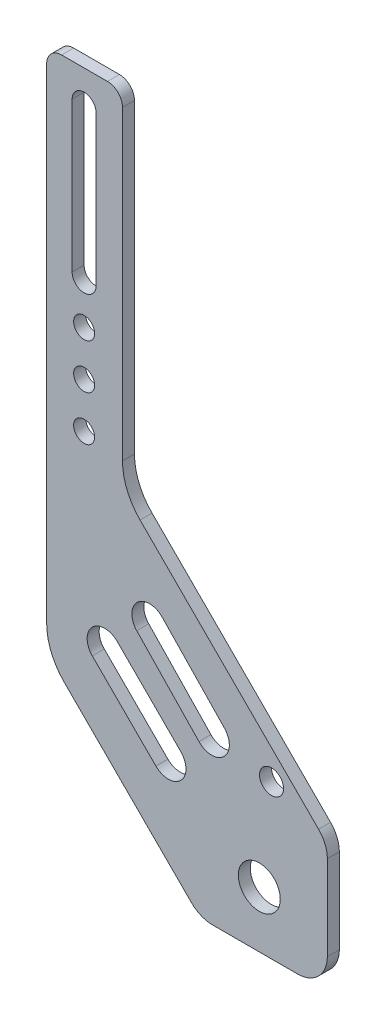
ISO-10303-21;
HEADER;
FILE_DESCRIPTION(('STEP AP214'),'2;1');
FILE_NAME('part.step','',(''),(''),'','','');
FILE_SCHEMA(('AUTOMOTIVE_DESIGN { 1 0 10303 214 1 1 1 1 }'));
ENDSEC;
DATA;
#1=APPLICATION_CONTEXT('core data for automotive mechanical design processes');
#2=APPLICATION_PROTOCOL_DEFINITION('international standard','automotive_design',2000,#1);
#3=PRODUCT_CONTEXT('',#1,'mechanical');
#4=PRODUCT('Part','Part','',(#3));
#5=PRODUCT_RELATED_PRODUCT_CATEGORY('part','',(#4));
#6=PRODUCT_DEFINITION_FORMATION('','',#4);
#7=PRODUCT_DEFINITION_CONTEXT('part definition',#1,'design');
#8=PRODUCT_DEFINITION('design','',#6,#7);
#9=PRODUCT_DEFINITION_SHAPE('','',#8);
#10=(LENGTH_UNIT() NAMED_UNIT(*) SI_UNIT(.MILLI.,.METRE.));
#11=(NAMED_UNIT(*) PLANE_ANGLE_UNIT() SI_UNIT($,.RADIAN.));
#12=(NAMED_UNIT(*) SI_UNIT($,.STERADIAN.) SOLID_ANGLE_UNIT());
#13=UNCERTAINTY_MEASURE_WITH_UNIT(LENGTH_MEASURE(1.E-05),#10,'distance_accuracy_value','');
#14=(GEOMETRIC_REPRESENTATION_CONTEXT(3) GLOBAL_UNCERTAINTY_ASSIGNED_CONTEXT((#13)) GLOBAL_UNIT_ASSIGNED_CONTEXT((#10,
#11,#12)) REPRESENTATION_CONTEXT('',''));
#15=CARTESIAN_POINT('',(0.,0.,0.));
#16=DIRECTION('',(0.,0.,1.));
#17=DIRECTION('',(1.,0.,0.));
#18=AXIS2_PLACEMENT_3D('',#15,#16,#17);
#19=CARTESIAN_POINT('',(0.,-96.2377499931107,4.));
#20=DIRECTION('',(0.,1.,0.));
#21=DIRECTION('',(0.,0.,1.));
#22=AXIS2_PLACEMENT_3D('',#19,#20,#21);
#23=PLANE('',#22);
#24=DIRECTION('',(1.,0.,0.));
#25=VECTOR('',#24,1.);
#26=CARTESIAN_POINT('',(0.,-96.2377499931107,0.));
#27=LINE('',#26,#25);
#28=CARTESIAN_POINT('',(55.3798856168415,-96.2377499931107,0.));
#29=VERTEX_POINT('',#28);
#30=CARTESIAN_POINT('',(83.6641568643034,-96.2377499931107,0.));
#31=VERTEX_POINT('',#30);
#32=EDGE_CURVE('E321',#29,#31,#27,.T.);
#33=ORIENTED_EDGE('',*,*,#32,.T.);
#34=DIRECTION('',(0.,0.,-1.));
#35=VECTOR('',#34,1.);
#36=CARTESIAN_POINT('',(83.6641568643034,-96.2377499931107,4.));
#37=LINE('',#36,#35);
#38=CARTESIAN_POINT('',(83.6641568643034,-96.2377499931107,4.));
#39=VERTEX_POINT('',#38);
#40=EDGE_CURVE('E11',#39,#31,#37,.T.);
#41=ORIENTED_EDGE('',*,*,#40,.F.);
#42=DIRECTION('',(1.,0.,0.));
#43=VECTOR('',#42,1.);
#44=CARTESIAN_POINT('',(0.,-96.2377499931107,4.));
#45=LINE('',#44,#43);
#46=CARTESIAN_POINT('',(55.3798856168415,-96.2377499931107,4.));
#47=VERTEX_POINT('',#46);
#48=EDGE_CURVE('E517',#47,#39,#45,.T.);
#49=ORIENTED_EDGE('',*,*,#48,.F.);
#50=DIRECTION('',(0.,0.,-1.));
#51=VECTOR('',#50,1.);
#52=CARTESIAN_POINT('',(55.3798856168415,-96.2377499931107,4.));
#53=LINE('',#52,#51);
#54=EDGE_CURVE('E367',#47,#29,#53,.T.);
#55=ORIENTED_EDGE('',*,*,#54,.T.);
#56=EDGE_LOOP('',(#33,#41,#49,#55));
#57=FACE_BOUND('',#56,.T.);
#58=ADVANCED_FACE('F41',(#57),#23,.F.);
#59=CARTESIAN_POINT('',(83.6641568643035,-86.2377499931107,4.));
#60=DIRECTION('',(0.,0.,-1.));
#61=DIRECTION('',(-1.,0.,0.));
#62=AXIS2_PLACEMENT_3D('',#59,#60,#61);
#63=CYLINDRICAL_SURFACE('',#62,9.99999999999999);
#64=CARTESIAN_POINT('',(83.6641568643035,-86.2377499931107,0.));
#65=DIRECTION('',(0.,0.,1.));
#66=DIRECTION('',(1.,0.,0.));
#67=AXIS2_PLACEMENT_3D('',#64,#65,#66);
#68=CIRCLE('',#67,9.99999999999999);
#69=CARTESIAN_POINT('',(93.6641568643035,-86.2377499931106,0.));
#70=VERTEX_POINT('',#69);
#71=EDGE_CURVE('E325',#31,#70,#68,.T.);
#72=ORIENTED_EDGE('',*,*,#71,.T.);
#73=DIRECTION('',(0.,0.,-1.));
#74=VECTOR('',#73,1.);
#75=CARTESIAN_POINT('',(93.6641568643035,-86.2377499931106,4.));
#76=LINE('',#75,#74);
#77=CARTESIAN_POINT('',(93.6641568643035,-86.2377499931106,4.));
#78=VERTEX_POINT('',#77);
#79=EDGE_CURVE('E52',#78,#70,#76,.T.);
#80=ORIENTED_EDGE('',*,*,#79,.F.);
#81=CARTESIAN_POINT('',(83.6641568643035,-86.2377499931107,4.));
#82=DIRECTION('',(0.,0.,1.));
#83=DIRECTION('',(1.,0.,0.));
#84=AXIS2_PLACEMENT_3D('',#81,#82,#83);
#85=CIRCLE('',#84,9.99999999999999);
#86=EDGE_CURVE('E520',#39,#78,#85,.T.);
#87=ORIENTED_EDGE('',*,*,#86,.F.);
#88=ORIENTED_EDGE('',*,*,#40,.T.);
#89=EDGE_LOOP('',(#72,#80,#87,#88));
#90=FACE_BOUND('',#89,.T.);
#91=ADVANCED_FACE('F573',(#90),#63,.T.);
#92=CARTESIAN_POINT('',(93.6641568643035,0.,4.));
#93=DIRECTION('',(-1.,0.,0.));
#94=DIRECTION('',(0.,0.,1.));
#95=AXIS2_PLACEMENT_3D('',#92,#93,#94);
#96=PLANE('',#95);
#97=DIRECTION('',(0.,1.,0.));
#98=VECTOR('',#97,1.);
#99=CARTESIAN_POINT('',(93.6641568643035,0.,0.));
#100=LINE('',#99,#98);
#101=CARTESIAN_POINT('',(93.6641568643035,-57.9534787456488,0.));
#102=VERTEX_POINT('',#101);
#103=EDGE_CURVE('E328',#70,#102,#100,.T.);
#104=ORIENTED_EDGE('',*,*,#103,.T.);
#105=DIRECTION('',(0.,0.,-1.));
#106=VECTOR('',#105,1.);
#107=CARTESIAN_POINT('',(93.6641568643035,-57.9534787456488,4.));
#108=LINE('',#107,#106);
#109=CARTESIAN_POINT('',(93.6641568643035,-57.9534787456488,4.));
#110=VERTEX_POINT('',#109);
#111=EDGE_CURVE('E399',#110,#102,#108,.T.);
#112=ORIENTED_EDGE('',*,*,#111,.F.);
#113=DIRECTION('',(0.,1.,0.));
#114=VECTOR('',#113,1.);
#115=CARTESIAN_POINT('',(93.6641568643035,0.,4.));
#116=LINE('',#115,#114);
#117=EDGE_CURVE('E523',#78,#110,#116,.T.);
#118=ORIENTED_EDGE('',*,*,#117,.F.);
#119=ORIENTED_EDGE('',*,*,#79,.T.);
#120=EDGE_LOOP('',(#104,#112,#118,#119));
#121=FACE_BOUND('',#120,.T.);
#122=ADVANCED_FACE('F578',(#121),#96,.F.);
#123=CARTESIAN_POINT('',(83.6641568643035,-57.9534787456487,4.));
#124=DIRECTION('',(0.,0.,-1.));
#125=DIRECTION('',(-1.,0.,0.));
#126=AXIS2_PLACEMENT_3D('',#123,#124,#125);
#127=CYLINDRICAL_SURFACE('',#126,10.);
#128=CARTESIAN_POINT('',(83.6641568643035,-57.9534787456487,0.));
#129=DIRECTION('',(0.,0.,1.));
#130=DIRECTION('',(1.,0.,0.));
#131=AXIS2_PLACEMENT_3D('',#128,#129,#130);
#132=CIRCLE('',#131,10.);
#133=CARTESIAN_POINT('',(90.7352246761689,-50.8824109337832,0.));
#134=VERTEX_POINT('',#133);
#135=EDGE_CURVE('E331',#102,#134,#132,.T.);
#136=ORIENTED_EDGE('',*,*,#135,.T.);
#137=DIRECTION('',(0.,0.,-1.));
#138=VECTOR('',#137,1.);
#139=CARTESIAN_POINT('',(90.7352246761689,-50.8824109337832,4.));
#140=LINE('',#139,#138);
#141=CARTESIAN_POINT('',(90.7352246761689,-50.8824109337832,4.));
#142=VERTEX_POINT('',#141);
#143=EDGE_CURVE('E395',#142,#134,#140,.T.);
#144=ORIENTED_EDGE('',*,*,#143,.F.);
#145=CARTESIAN_POINT('',(83.6641568643035,-57.9534787456487,4.));
#146=DIRECTION('',(0.,0.,1.));
#147=DIRECTION('',(1.,0.,0.));
#148=AXIS2_PLACEMENT_3D('',#145,#146,#147);
#149=CIRCLE('',#148,10.);
#150=EDGE_CURVE('E526',#110,#142,#149,.T.);
#151=ORIENTED_EDGE('',*,*,#150,.F.);
#152=ORIENTED_EDGE('',*,*,#111,.T.);
#153=EDGE_LOOP('',(#136,#144,#151,#152));
#154=FACE_BOUND('',#153,.T.);
#155=ADVANCED_FACE('F729',(#154),#127,.T.);
#156=CARTESIAN_POINT('',(19.9264068711924,19.9264068711926,4.));
#157=DIRECTION('',(-0.707106781186544,-0.707106781186551,0.));
#158=DIRECTION('',(0.707106781186551,-0.707106781186544,0.));
#159=AXIS2_PLACEMENT_3D('',#156,#157,#158);
#160=PLANE('',#159);
#161=DIRECTION('',(-0.707106781186551,0.707106781186544,0.));
#162=VECTOR('',#161,1.);
#163=CARTESIAN_POINT('',(19.9264068711924,19.9264068711926,0.));
#164=LINE('',#163,#162);
#165=CARTESIAN_POINT('',(31.159701747021,8.69311199536404,0.));
#166=VERTEX_POINT('',#165);
#167=EDGE_CURVE('E334',#134,#166,#164,.T.);
#168=ORIENTED_EDGE('',*,*,#167,.T.);
#169=DIRECTION('',(0.,0.,-1.));
#170=VECTOR('',#169,1.);
#171=CARTESIAN_POINT('',(31.159701747021,8.69311199536404,4.));
#172=LINE('',#171,#170);
#173=CARTESIAN_POINT('',(31.159701747021,8.69311199536404,4.));
#174=VERTEX_POINT('',#173);
#175=EDGE_CURVE('E391',#174,#166,#172,.T.);
#176=ORIENTED_EDGE('',*,*,#175,.F.);
#177=DIRECTION('',(-0.707106781186551,0.707106781186544,0.));
#178=VECTOR('',#177,1.);
#179=CARTESIAN_POINT('',(19.9264068711924,19.9264068711926,4.));
#180=LINE('',#179,#178);
#181=EDGE_CURVE('E529',#142,#174,#180,.T.);
#182=ORIENTED_EDGE('',*,*,#181,.F.);
#183=ORIENTED_EDGE('',*,*,#143,.T.);
#184=EDGE_LOOP('',(#168,#176,#182,#183));
#185=FACE_BOUND('',#184,.T.);
#186=ADVANCED_FACE('F721',(#185),#160,.F.);
#187=CARTESIAN_POINT('',(45.3018373707518,22.8352476190951,4.));
#188=DIRECTION('',(0.,0.,-1.));
#189=DIRECTION('',(-1.,0.,0.));
#190=AXIS2_PLACEMENT_3D('',#187,#188,#189);
#191=CYLINDRICAL_SURFACE('',#190,20.);
#192=CARTESIAN_POINT('',(45.3018373707518,22.8352476190951,0.));
#193=DIRECTION('',(0.,0.,1.));
#194=DIRECTION('',(1.,0.,0.));
#195=AXIS2_PLACEMENT_3D('',#192,#193,#194);
#196=CIRCLE('',#195,20.);
#197=CARTESIAN_POINT('',(25.3018373707518,22.8352476190952,0.));
#198=VERTEX_POINT('',#197);
#199=EDGE_CURVE('E337',#166,#198,#196,.F.);
#200=ORIENTED_EDGE('',*,*,#199,.T.);
#201=DIRECTION('',(0.,0.,-1.));
#202=VECTOR('',#201,1.);
#203=CARTESIAN_POINT('',(25.3018373707518,22.8352476190952,4.));
#204=LINE('',#203,#202);
#205=CARTESIAN_POINT('',(25.3018373707518,22.8352476190952,4.));
#206=VERTEX_POINT('',#205);
#207=EDGE_CURVE('E387',#206,#198,#204,.T.);
#208=ORIENTED_EDGE('',*,*,#207,.F.);
#209=CARTESIAN_POINT('',(45.3018373707518,22.8352476190951,4.));
#210=DIRECTION('',(0.,0.,1.));
#211=DIRECTION('',(1.,0.,0.));
#212=AXIS2_PLACEMENT_3D('',#209,#210,#211);
#213=CIRCLE('',#212,20.);
#214=EDGE_CURVE('E532',#174,#206,#213,.F.);
#215=ORIENTED_EDGE('',*,*,#214,.F.);
#216=ORIENTED_EDGE('',*,*,#175,.T.);
#217=EDGE_LOOP('',(#200,#208,#215,#216));
#218=FACE_BOUND('',#217,.T.);
#219=ADVANCED_FACE('F713',(#218),#191,.F.);
#220=CARTESIAN_POINT('',(25.3018373707518,0.,4.));
#221=DIRECTION('',(-1.,0.,0.));
#222=DIRECTION('',(0.,-1.,0.));
#223=AXIS2_PLACEMENT_3D('',#220,#221,#222);
#224=PLANE('',#223);
#225=DIRECTION('',(0.,1.,0.));
#226=VECTOR('',#225,1.);
#227=CARTESIAN_POINT('',(25.3018373707518,0.,0.));
#228=LINE('',#227,#226);
#229=CARTESIAN_POINT('',(25.3018373707518,125.,0.));
#230=VERTEX_POINT('',#229);
#231=EDGE_CURVE('E340',#198,#230,#228,.T.);
#232=ORIENTED_EDGE('',*,*,#231,.T.);
#233=DIRECTION('',(0.,0.,-1.));
#234=VECTOR('',#233,1.);
#235=CARTESIAN_POINT('',(25.3018373707518,125.,4.));
#236=LINE('',#235,#234);
#237=CARTESIAN_POINT('',(25.3018373707518,125.,4.));
#238=VERTEX_POINT('',#237);
#239=EDGE_CURVE('E384',#238,#230,#236,.T.);
#240=ORIENTED_EDGE('',*,*,#239,.F.);
#241=DIRECTION('',(0.,1.,0.));
#242=VECTOR('',#241,1.);
#243=CARTESIAN_POINT('',(25.3018373707518,0.,4.));
#244=LINE('',#243,#242);
#245=EDGE_CURVE('E535',#206,#238,#244,.T.);
#246=ORIENTED_EDGE('',*,*,#245,.F.);
#247=ORIENTED_EDGE('',*,*,#207,.T.);
#248=EDGE_LOOP('',(#232,#240,#246,#247));
#249=FACE_BOUND('',#248,.T.);
#250=ADVANCED_FACE('F705',(#249),#224,.F.);
#251=CARTESIAN_POINT('',(20.3018373707518,125.,4.));
#252=DIRECTION('',(0.,0.,-1.));
#253=DIRECTION('',(-1.,0.,0.));
#254=AXIS2_PLACEMENT_3D('',#251,#252,#253);
#255=CYLINDRICAL_SURFACE('',#254,5.);
#256=CARTESIAN_POINT('',(20.3018373707518,125.,0.));
#257=DIRECTION('',(0.,0.,1.));
#258=DIRECTION('',(1.,0.,0.));
#259=AXIS2_PLACEMENT_3D('',#256,#257,#258);
#260=CIRCLE('',#259,5.);
#261=CARTESIAN_POINT('',(20.3018373707518,130.,0.));
#262=VERTEX_POINT('',#261);
#263=EDGE_CURVE('E344',#262,#230,#260,.F.);
#264=ORIENTED_EDGE('',*,*,#263,.F.);
#265=DIRECTION('',(0.,0.,-1.));
#266=VECTOR('',#265,1.);
#267=CARTESIAN_POINT('',(20.3018373707518,130.,4.));
#268=LINE('',#267,#266);
#269=CARTESIAN_POINT('',(20.3018373707518,130.,4.));
#270=VERTEX_POINT('',#269);
#271=EDGE_CURVE('E381',#270,#262,#268,.T.);
#272=ORIENTED_EDGE('',*,*,#271,.F.);
#273=CARTESIAN_POINT('',(20.3018373707518,125.,4.));
#274=DIRECTION('',(0.,0.,1.));
#275=DIRECTION('',(1.,0.,0.));
#276=AXIS2_PLACEMENT_3D('',#273,#274,#275);
#277=CIRCLE('',#276,5.);
#278=EDGE_CURVE('E538',#270,#238,#277,.F.);
#279=ORIENTED_EDGE('',*,*,#278,.T.);
#280=ORIENTED_EDGE('',*,*,#239,.T.);
#281=EDGE_LOOP('',(#264,#272,#279,#280));
#282=FACE_BOUND('',#281,.T.);
#283=ADVANCED_FACE('F697',(#282),#255,.T.);
#284=CARTESIAN_POINT('',(0.,130.,4.));
#285=DIRECTION('',(0.,1.,0.));
#286=DIRECTION('',(0.,0.,1.));
#287=AXIS2_PLACEMENT_3D('',#284,#285,#286);
#288=PLANE('',#287);
#289=DIRECTION('',(1.,0.,0.));
#290=VECTOR('',#289,1.);
#291=CARTESIAN_POINT('',(0.,130.,0.));
#292=LINE('',#291,#290);
#293=CARTESIAN_POINT('',(5.,130.,0.));
#294=VERTEX_POINT('',#293);
#295=EDGE_CURVE('E348',#294,#262,#292,.T.);
#296=ORIENTED_EDGE('',*,*,#295,.F.);
#297=DIRECTION('',(0.,0.,-1.));
#298=VECTOR('',#297,1.);
#299=CARTESIAN_POINT('',(5.,130.,4.));
#300=LINE('',#299,#298);
#301=CARTESIAN_POINT('',(5.,130.,4.));
#302=VERTEX_POINT('',#301);
#303=EDGE_CURVE('E378',#302,#294,#300,.T.);
#304=ORIENTED_EDGE('',*,*,#303,.F.);
#305=DIRECTION('',(1.,0.,0.));
#306=VECTOR('',#305,1.);
#307=CARTESIAN_POINT('',(0.,130.,4.));
#308=LINE('',#307,#306);
#309=EDGE_CURVE('E542',#302,#270,#308,.T.);
#310=ORIENTED_EDGE('',*,*,#309,.T.);
#311=ORIENTED_EDGE('',*,*,#271,.T.);
#312=EDGE_LOOP('',(#296,#304,#310,#311));
#313=FACE_BOUND('',#312,.T.);
#314=ADVANCED_FACE('F689',(#313),#288,.T.);
#315=CARTESIAN_POINT('',(5.,125.,4.));
#316=DIRECTION('',(0.,0.,-1.));
#317=DIRECTION('',(-1.,0.,0.));
#318=AXIS2_PLACEMENT_3D('',#315,#316,#317);
#319=CYLINDRICAL_SURFACE('',#318,5.);
#320=CARTESIAN_POINT('',(5.,125.,0.));
#321=DIRECTION('',(0.,0.,1.));
#322=DIRECTION('',(1.,0.,0.));
#323=AXIS2_PLACEMENT_3D('',#320,#321,#322);
#324=CIRCLE('',#323,5.);
#325=CARTESIAN_POINT('',(0.,125.,0.));
#326=VERTEX_POINT('',#325);
#327=EDGE_CURVE('E352',#294,#326,#324,.T.);
#328=ORIENTED_EDGE('',*,*,#327,.T.);
#329=DIRECTION('',(0.,0.,-1.));
#330=VECTOR('',#329,1.);
#331=CARTESIAN_POINT('',(0.,125.,4.));
#332=LINE('',#331,#330);
#333=CARTESIAN_POINT('',(0.,125.,4.));
#334=VERTEX_POINT('',#333);
#335=EDGE_CURVE('E375',#334,#326,#332,.T.);
#336=ORIENTED_EDGE('',*,*,#335,.F.);
#337=CARTESIAN_POINT('',(5.,125.,4.));
#338=DIRECTION('',(0.,0.,1.));
#339=DIRECTION('',(1.,0.,0.));
#340=AXIS2_PLACEMENT_3D('',#337,#338,#339);
#341=CIRCLE('',#340,5.);
#342=EDGE_CURVE('E546',#302,#334,#341,.T.);
#343=ORIENTED_EDGE('',*,*,#342,.F.);
#344=ORIENTED_EDGE('',*,*,#303,.T.);
#345=EDGE_LOOP('',(#328,#336,#343,#344));
#346=FACE_BOUND('',#345,.T.);
#347=ADVANCED_FACE('F682',(#346),#319,.T.);
#348=CARTESIAN_POINT('',(0.,0.,4.));
#349=DIRECTION('',(-1.,0.,0.));
#350=DIRECTION('',(0.,0.,1.));
#351=AXIS2_PLACEMENT_3D('',#348,#349,#350);
#352=PLANE('',#351);
#353=DIRECTION('',(0.,1.,0.));
#354=VECTOR('',#353,1.);
#355=CARTESIAN_POINT('',(0.,0.,0.));
#356=LINE('',#355,#354);
#357=CARTESIAN_POINT('',(0.,-36.715728752538,0.));
#358=VERTEX_POINT('',#357);
#359=EDGE_CURVE('E356',#358,#326,#356,.T.);
#360=ORIENTED_EDGE('',*,*,#359,.F.);
#361=DIRECTION('',(0.,0.,-1.));
#362=VECTOR('',#361,1.);
#363=CARTESIAN_POINT('',(0.,-36.715728752538,4.));
#364=LINE('',#363,#362);
#365=CARTESIAN_POINT('',(0.,-36.715728752538,4.));
#366=VERTEX_POINT('',#365);
#367=EDGE_CURVE('E243',#366,#358,#364,.T.);
#368=ORIENTED_EDGE('',*,*,#367,.F.);
#369=DIRECTION('',(0.,1.,0.));
#370=VECTOR('',#369,1.);
#371=CARTESIAN_POINT('',(0.,0.,4.));
#372=LINE('',#371,#370);
#373=EDGE_CURVE('E234',#366,#334,#372,.T.);
#374=ORIENTED_EDGE('',*,*,#373,.T.);
#375=ORIENTED_EDGE('',*,*,#335,.T.);
#376=EDGE_LOOP('',(#360,#368,#374,#375));
#377=FACE_BOUND('',#376,.T.);
#378=ADVANCED_FACE('F551',(#377),#352,.T.);
#379=CARTESIAN_POINT('',(20.,-36.7157287525381,4.));
#380=DIRECTION('',(0.,0.,-1.));
#381=DIRECTION('',(-1.,0.,0.));
#382=AXIS2_PLACEMENT_3D('',#379,#380,#381);
#383=CYLINDRICAL_SURFACE('',#382,20.);
#384=CARTESIAN_POINT('',(20.,-36.7157287525381,0.));
#385=DIRECTION('',(0.,0.,1.));
#386=DIRECTION('',(1.,0.,0.));
#387=AXIS2_PLACEMENT_3D('',#384,#385,#386);
#388=CIRCLE('',#387,20.);
#389=CARTESIAN_POINT('',(5.85786437626909,-50.8578643762691,0.));
#390=VERTEX_POINT('',#389);
#391=EDGE_CURVE('E241',#358,#390,#388,.T.);
#392=ORIENTED_EDGE('',*,*,#391,.T.);
#393=DIRECTION('',(0.,0.,-1.));
#394=VECTOR('',#393,1.);
#395=CARTESIAN_POINT('',(5.85786437626909,-50.8578643762691,4.));
#396=LINE('',#395,#394);
#397=CARTESIAN_POINT('',(5.85786437626909,-50.8578643762691,4.));
#398=VERTEX_POINT('',#397);
#399=EDGE_CURVE('E238',#398,#390,#396,.T.);
#400=ORIENTED_EDGE('',*,*,#399,.F.);
#401=CARTESIAN_POINT('',(20.,-36.7157287525381,4.));
#402=DIRECTION('',(0.,0.,1.));
#403=DIRECTION('',(1.,0.,0.));
#404=AXIS2_PLACEMENT_3D('',#401,#402,#403);
#405=CIRCLE('',#404,20.);
#406=EDGE_CURVE('E228',#366,#398,#405,.T.);
#407=ORIENTED_EDGE('',*,*,#406,.F.);
#408=ORIENTED_EDGE('',*,*,#367,.T.);
#409=EDGE_LOOP('',(#392,#400,#407,#408));
#410=FACE_BOUND('',#409,.T.);
#411=ADVANCED_FACE('F239',(#410),#383,.T.);
#412=CARTESIAN_POINT('',(-22.5,-22.4999999999999,4.));
#413=DIRECTION('',(0.707106781186549,0.707106781186546,0.));
#414=DIRECTION('',(-0.707106781186546,0.707106781186549,0.));
#415=AXIS2_PLACEMENT_3D('',#412,#413,#414);
#416=PLANE('',#415);
#417=DIRECTION('',(0.707106781186546,-0.707106781186549,0.));
#418=VECTOR('',#417,1.);
#419=CARTESIAN_POINT('',(-22.5,-22.4999999999999,0.));
#420=LINE('',#419,#418);
#421=CARTESIAN_POINT('',(48.3088178049759,-93.3088178049761,0.));
#422=VERTEX_POINT('',#421);
#423=EDGE_CURVE('E144',#390,#422,#420,.T.);
#424=ORIENTED_EDGE('',*,*,#423,.T.);
#425=DIRECTION('',(0.,0.,-1.));
#426=VECTOR('',#425,1.);
#427=CARTESIAN_POINT('',(48.3088178049759,-93.3088178049761,4.));
#428=LINE('',#427,#426);
#429=CARTESIAN_POINT('',(48.3088178049759,-93.3088178049761,4.));
#430=VERTEX_POINT('',#429);
#431=EDGE_CURVE('E244',#430,#422,#428,.T.);
#432=ORIENTED_EDGE('',*,*,#431,.F.);
#433=DIRECTION('',(0.707106781186546,-0.707106781186549,0.));
#434=VECTOR('',#433,1.);
#435=CARTESIAN_POINT('',(-22.5,-22.4999999999999,4.));
#436=LINE('',#435,#434);
#437=EDGE_CURVE('E232',#398,#430,#436,.T.);
#438=ORIENTED_EDGE('',*,*,#437,.F.);
#439=ORIENTED_EDGE('',*,*,#399,.T.);
#440=EDGE_LOOP('',(#424,#432,#438,#439));
#441=FACE_BOUND('',#440,.T.);
#442=ADVANCED_FACE('F246',(#441),#416,.F.);
#443=CARTESIAN_POINT('',(40.6066017177982,-55.6066017177982,4.));
#444=DIRECTION('',(0.,0.,-1.));
#445=DIRECTION('',(-1.,0.,0.));
#446=AXIS2_PLACEMENT_3D('',#443,#444,#445);
#447=CYLINDRICAL_SURFACE('',#446,5.88335792138499);
#448=CARTESIAN_POINT('',(40.6066017177982,-55.6066017177982,0.));
#449=DIRECTION('',(0.,0.,1.));
#450=DIRECTION('',(1.,0.,0.));
#451=AXIS2_PLACEMENT_3D('',#448,#449,#450);
#452=CIRCLE('',#451,5.88335792138499);
#453=CARTESIAN_POINT('',(36.4464394354393,-59.7667640001571,0.));
#454=VERTEX_POINT('',#453);
#455=CARTESIAN_POINT('',(44.7667640001571,-51.4464394354393,0.));
#456=VERTEX_POINT('',#455);
#457=EDGE_CURVE('E297',#454,#456,#452,.T.);
#458=ORIENTED_EDGE('',*,*,#457,.F.);
#459=DIRECTION('',(0.,0.,-1.));
#460=VECTOR('',#459,1.);
#461=CARTESIAN_POINT('',(36.4464394354393,-59.7667640001571,4.));
#462=LINE('',#461,#460);
#463=CARTESIAN_POINT('',(36.4464394354393,-59.7667640001571,4.));
#464=VERTEX_POINT('',#463);
#465=EDGE_CURVE('E370',#464,#454,#462,.T.);
#466=ORIENTED_EDGE('',*,*,#465,.F.);
#467=CARTESIAN_POINT('',(40.6066017177982,-55.6066017177982,4.));
#468=DIRECTION('',(0.,0.,1.));
#469=DIRECTION('',(1.,0.,0.));
#470=AXIS2_PLACEMENT_3D('',#467,#468,#469);
#471=CIRCLE('',#470,5.88335792138499);
#472=CARTESIAN_POINT('',(44.7667640001571,-51.4464394354393,4.));
#473=VERTEX_POINT('',#472);
#474=EDGE_CURVE('E494',#464,#473,#471,.T.);
#475=ORIENTED_EDGE('',*,*,#474,.T.);
#476=DIRECTION('',(0.,0.,-1.));
#477=VECTOR('',#476,1.);
#478=CARTESIAN_POINT('',(44.7667640001571,-51.4464394354393,4.));
#479=LINE('',#478,#477);
#480=EDGE_CURVE('E406',#473,#456,#479,.T.);
#481=ORIENTED_EDGE('',*,*,#480,.T.);
#482=EDGE_LOOP('',(#458,#466,#475,#481));
#483=FACE_BOUND('',#482,.T.);
#484=ADVANCED_FACE('F604',(#483),#447,.F.);
#485=CARTESIAN_POINT('',(-11.6601622823589,-11.6601622823589,4.));
#486=DIRECTION('',(0.707106781186547,0.707106781186548,0.));
#487=DIRECTION('',(-0.707106781186548,0.707106781186547,0.));
#488=AXIS2_PLACEMENT_3D('',#485,#486,#487);
#489=PLANE('',#488);
#490=DIRECTION('',(0.707106781186548,-0.707106781186547,0.));
#491=VECTOR('',#490,1.);
#492=CARTESIAN_POINT('',(-11.6601622823589,-11.6601622823589,0.));
#493=LINE('',#492,#491);
#494=CARTESIAN_POINT('',(15.2332359998429,-38.5535605645607,0.));
#495=VERTEX_POINT('',#494);
#496=EDGE_CURVE('E301',#495,#454,#493,.T.);
#497=ORIENTED_EDGE('',*,*,#496,.F.);
#498=DIRECTION('',(0.,0.,-1.));
#499=VECTOR('',#498,1.);
#500=CARTESIAN_POINT('',(15.2332359998429,-38.5535605645607,4.));
#501=LINE('',#500,#499);
#502=CARTESIAN_POINT('',(15.2332359998429,-38.5535605645607,4.));
#503=VERTEX_POINT('',#502);
#504=EDGE_CURVE('E413',#503,#495,#501,.T.);
#505=ORIENTED_EDGE('',*,*,#504,.F.);
#506=DIRECTION('',(0.707106781186548,-0.707106781186547,0.));
#507=VECTOR('',#506,1.);
#508=CARTESIAN_POINT('',(-11.6601622823589,-11.6601622823589,4.));
#509=LINE('',#508,#507);
#510=EDGE_CURVE('E498',#503,#464,#509,.T.);
#511=ORIENTED_EDGE('',*,*,#510,.T.);
#512=ORIENTED_EDGE('',*,*,#465,.T.);
#513=EDGE_LOOP('',(#497,#505,#511,#512));
#514=FACE_BOUND('',#513,.T.);
#515=ADVANCED_FACE('F600',(#514),#489,.T.);
#516=CARTESIAN_POINT('',(19.3933982822018,-34.3933982822018,4.));
#517=DIRECTION('',(0.,0.,-1.));
#518=DIRECTION('',(-1.,0.,0.));
#519=AXIS2_PLACEMENT_3D('',#516,#517,#518);
#520=CYLINDRICAL_SURFACE('',#519,5.88335792138499);
#521=CARTESIAN_POINT('',(19.3933982822018,-34.3933982822018,0.));
#522=DIRECTION('',(0.,0.,1.));
#523=DIRECTION('',(1.,0.,0.));
#524=AXIS2_PLACEMENT_3D('',#521,#522,#523);
#525=CIRCLE('',#524,5.88335792138499);
#526=CARTESIAN_POINT('',(23.5535605645607,-30.2332359998429,0.));
#527=VERTEX_POINT('',#526);
#528=EDGE_CURVE('E305',#527,#495,#525,.T.);
#529=ORIENTED_EDGE('',*,*,#528,.F.);
#530=DIRECTION('',(0.,0.,-1.));
#531=VECTOR('',#530,1.);
#532=CARTESIAN_POINT('',(23.5535605645607,-30.2332359998429,4.));
#533=LINE('',#532,#531);
#534=CARTESIAN_POINT('',(23.5535605645607,-30.2332359998429,4.));
#535=VERTEX_POINT('',#534);
#536=EDGE_CURVE('E409',#535,#527,#533,.T.);
#537=ORIENTED_EDGE('',*,*,#536,.F.);
#538=CARTESIAN_POINT('',(19.3933982822018,-34.3933982822018,4.));
#539=DIRECTION('',(0.,0.,1.));
#540=DIRECTION('',(1.,0.,0.));
#541=AXIS2_PLACEMENT_3D('',#538,#539,#540);
#542=CIRCLE('',#541,5.88335792138499);
#543=EDGE_CURVE('E502',#535,#503,#542,.T.);
#544=ORIENTED_EDGE('',*,*,#543,.T.);
#545=ORIENTED_EDGE('',*,*,#504,.T.);
#546=EDGE_LOOP('',(#529,#537,#544,#545));
#547=FACE_BOUND('',#546,.T.);
#548=ADVANCED_FACE('F596',(#547),#520,.F.);
#549=CARTESIAN_POINT('',(12.5,69.,4.));
#550=DIRECTION('',(0.,0.,-1.));
#551=DIRECTION('',(-1.,0.,0.));
#552=AXIS2_PLACEMENT_3D('',#549,#550,#551);
#553=CYLINDRICAL_SURFACE('',#552,4.);
#554=CARTESIAN_POINT('',(12.5,69.,0.));
#555=DIRECTION('',(0.,0.,1.));
#556=DIRECTION('',(1.,0.,0.));
#557=AXIS2_PLACEMENT_3D('',#554,#555,#556);
#558=CIRCLE('',#557,4.);
#559=CARTESIAN_POINT('',(8.49999999999998,69.,0.));
#560=VERTEX_POINT('',#559);
#561=CARTESIAN_POINT('',(16.5,69.,0.));
#562=VERTEX_POINT('',#561);
#563=EDGE_CURVE('E269',#560,#562,#558,.T.);
#564=ORIENTED_EDGE('',*,*,#563,.F.);
#565=DIRECTION('',(0.,0.,-1.));
#566=VECTOR('',#565,1.);
#567=CARTESIAN_POINT('',(8.49999999999998,69.,4.));
#568=LINE('',#567,#566);
#569=CARTESIAN_POINT('',(8.49999999999998,69.,4.));
#570=VERTEX_POINT('',#569);
#571=EDGE_CURVE('E410',#570,#560,#568,.T.);
#572=ORIENTED_EDGE('',*,*,#571,.F.);
#573=CARTESIAN_POINT('',(12.5,69.,4.));
#574=DIRECTION('',(0.,0.,1.));
#575=DIRECTION('',(1.,0.,0.));
#576=AXIS2_PLACEMENT_3D('',#573,#574,#575);
#577=CIRCLE('',#576,4.);
#578=CARTESIAN_POINT('',(16.5,69.,4.));
#579=VERTEX_POINT('',#578);
#580=EDGE_CURVE('E459',#570,#579,#577,.T.);
#581=ORIENTED_EDGE('',*,*,#580,.T.);
#582=DIRECTION('',(0.,0.,-1.));
#583=VECTOR('',#582,1.);
#584=CARTESIAN_POINT('',(16.5,69.,4.));
#585=LINE('',#584,#583);
#586=EDGE_CURVE('E418',#579,#562,#585,.T.);
#587=ORIENTED_EDGE('',*,*,#586,.T.);
#588=EDGE_LOOP('',(#564,#572,#581,#587));
#589=FACE_BOUND('',#588,.T.);
#590=ADVANCED_FACE('F599',(#589),#553,.F.);
#591=CARTESIAN_POINT('',(8.5,0.,4.));
#592=DIRECTION('',(1.,0.,0.));
#593=DIRECTION('',(0.,1.,0.));
#594=AXIS2_PLACEMENT_3D('',#591,#592,#593);
#595=PLANE('',#594);
#596=DIRECTION('',(0.,-1.,0.));
#597=VECTOR('',#596,1.);
#598=CARTESIAN_POINT('',(8.5,0.,0.));
#599=LINE('',#598,#597);
#600=CARTESIAN_POINT('',(8.49999999999996,119.,0.));
#601=VERTEX_POINT('',#600);
#602=EDGE_CURVE('E273',#601,#560,#599,.T.);
#603=ORIENTED_EDGE('',*,*,#602,.F.);
#604=DIRECTION('',(0.,0.,-1.));
#605=VECTOR('',#604,1.);
#606=CARTESIAN_POINT('',(8.49999999999996,119.,4.));
#607=LINE('',#606,#605);
#608=CARTESIAN_POINT('',(8.49999999999996,119.,4.));
#609=VERTEX_POINT('',#608);
#610=EDGE_CURVE('E424',#609,#601,#607,.T.);
#611=ORIENTED_EDGE('',*,*,#610,.F.);
#612=DIRECTION('',(0.,-1.,0.));
#613=VECTOR('',#612,1.);
#614=CARTESIAN_POINT('',(8.5,0.,4.));
#615=LINE('',#614,#613);
#616=EDGE_CURVE('E471',#609,#570,#615,.T.);
#617=ORIENTED_EDGE('',*,*,#616,.T.);
#618=ORIENTED_EDGE('',*,*,#571,.T.);
#619=EDGE_LOOP('',(#603,#611,#617,#618));
#620=FACE_BOUND('',#619,.T.);
#621=ADVANCED_FACE('F626',(#620),#595,.T.);
#622=CARTESIAN_POINT('',(12.5,119.,4.));
#623=DIRECTION('',(0.,0.,-1.));
#624=DIRECTION('',(-1.,0.,0.));
#625=AXIS2_PLACEMENT_3D('',#622,#623,#624);
#626=CYLINDRICAL_SURFACE('',#625,4.);
#627=CARTESIAN_POINT('',(12.5,119.,0.));
#628=DIRECTION('',(0.,0.,1.));
#629=DIRECTION('',(1.,0.,0.));
#630=AXIS2_PLACEMENT_3D('',#627,#628,#629);
#631=CIRCLE('',#630,4.);
#632=CARTESIAN_POINT('',(16.5,119.,0.));
#633=VERTEX_POINT('',#632);
#634=EDGE_CURVE('E277',#633,#601,#631,.T.);
#635=ORIENTED_EDGE('',*,*,#634,.F.);
#636=DIRECTION('',(0.,0.,-1.));
#637=VECTOR('',#636,1.);
#638=CARTESIAN_POINT('',(16.5,119.,4.));
#639=LINE('',#638,#637);
#640=CARTESIAN_POINT('',(16.5,119.,4.));
#641=VERTEX_POINT('',#640);
#642=EDGE_CURVE('E421',#641,#633,#639,.T.);
#643=ORIENTED_EDGE('',*,*,#642,.F.);
#644=CARTESIAN_POINT('',(12.5,119.,4.));
#645=DIRECTION('',(0.,0.,1.));
#646=DIRECTION('',(1.,0.,0.));
#647=AXIS2_PLACEMENT_3D('',#644,#645,#646);
#648=CIRCLE('',#647,4.);
#649=EDGE_CURVE('E475',#641,#609,#648,.T.);
#650=ORIENTED_EDGE('',*,*,#649,.T.);
#651=ORIENTED_EDGE('',*,*,#610,.T.);
#652=EDGE_LOOP('',(#635,#643,#650,#651));
#653=FACE_BOUND('',#652,.T.);
#654=ADVANCED_FACE('F623',(#653),#626,.F.);
#655=CARTESIAN_POINT('',(12.237774886856,11.7330660915952,4.));
#656=DIRECTION('',(0.721835011806536,0.69206518170636,0.));
#657=DIRECTION('',(-0.69206518170636,0.721835011806536,0.));
#658=AXIS2_PLACEMENT_3D('',#655,#656,#657);
#659=PLANE('',#658);
#660=DIRECTION('',(0.69206518170636,-0.721835011806536,0.));
#661=VECTOR('',#660,1.);
#662=CARTESIAN_POINT('',(12.237774886856,11.7330660915952,0.));
#663=LINE('',#662,#661);
#664=CARTESIAN_POINT('',(38.5557175556886,-15.716967459061,0.));
#665=VERTEX_POINT('',#664);
#666=CARTESIAN_POINT('',(59.3176730068794,-37.3720178132571,0.));
#667=VERTEX_POINT('',#666);
#668=EDGE_CURVE('E254',#665,#667,#663,.T.);
#669=ORIENTED_EDGE('',*,*,#668,.T.);
#670=DIRECTION('',(0.,0.,-1.));
#671=VECTOR('',#670,1.);
#672=CARTESIAN_POINT('',(59.3176730068794,-37.3720178132571,4.));
#673=LINE('',#672,#671);
#674=CARTESIAN_POINT('',(59.3176730068794,-37.3720178132571,4.));
#675=VERTEX_POINT('',#674);
#676=EDGE_CURVE('E45',#675,#667,#673,.T.);
#677=ORIENTED_EDGE('',*,*,#676,.F.);
#678=DIRECTION('',(0.69206518170636,-0.721835011806536,0.));
#679=VECTOR('',#678,1.);
#680=CARTESIAN_POINT('',(12.237774886856,11.7330660915952,4.));
#681=LINE('',#680,#679);
#682=CARTESIAN_POINT('',(38.5557175556886,-15.716967459061,4.));
#683=VERTEX_POINT('',#682);
#684=EDGE_CURVE('E366',#683,#675,#681,.T.);
#685=ORIENTED_EDGE('',*,*,#684,.F.);
#686=DIRECTION('',(0.,0.,-1.));
#687=VECTOR('',#686,1.);
#688=CARTESIAN_POINT('',(38.5557175556886,-15.716967459061,4.));
#689=LINE('',#688,#687);
#690=EDGE_CURVE('E250',#683,#665,#689,.T.);
#691=ORIENTED_EDGE('',*,*,#690,.T.);
#692=EDGE_LOOP('',(#669,#677,#685,#691));
#693=FACE_BOUND('',#692,.T.);
#694=ADVANCED_FACE('F43',(#693),#659,.F.);
#695=CARTESIAN_POINT('',(55.0708592722344,-41.4436849821639,4.));
#696=DIRECTION('',(0.,0.,-1.));
#697=DIRECTION('',(-1.,0.,0.));
#698=AXIS2_PLACEMENT_3D('',#695,#696,#697);
#699=CYLINDRICAL_SURFACE('',#698,5.88335792138499);
#700=CARTESIAN_POINT('',(55.0708592722344,-41.4436849821639,0.));
#701=DIRECTION('',(0.,0.,1.));
#702=DIRECTION('',(1.,0.,0.));
#703=AXIS2_PLACEMENT_3D('',#700,#701,#702);
#704=CIRCLE('',#703,5.88335792138499);
#705=CARTESIAN_POINT('',(50.8240455375894,-45.5153521510708,0.));
#706=VERTEX_POINT('',#705);
#707=EDGE_CURVE('E258',#667,#706,#704,.F.);
#708=ORIENTED_EDGE('',*,*,#707,.T.);
#709=DIRECTION('',(0.,0.,-1.));
#710=VECTOR('',#709,1.);
#711=CARTESIAN_POINT('',(50.8240455375894,-45.5153521510708,4.));
#712=LINE('',#711,#710);
#713=CARTESIAN_POINT('',(50.8240455375894,-45.5153521510708,4.));
#714=VERTEX_POINT('',#713);
#715=EDGE_CURVE('E434',#714,#706,#712,.T.);
#716=ORIENTED_EDGE('',*,*,#715,.F.);
#717=CARTESIAN_POINT('',(55.0708592722344,-41.4436849821639,4.));
#718=DIRECTION('',(0.,0.,1.));
#719=DIRECTION('',(1.,0.,0.));
#720=AXIS2_PLACEMENT_3D('',#717,#718,#719);
#721=CIRCLE('',#720,5.88335792138499);
#722=EDGE_CURVE('E159',#675,#714,#721,.F.);
#723=ORIENTED_EDGE('',*,*,#722,.F.);
#724=ORIENTED_EDGE('',*,*,#676,.T.);
#725=EDGE_LOOP('',(#708,#716,#723,#724));
#726=FACE_BOUND('',#725,.T.);
#727=ADVANCED_FACE('F441',(#726),#699,.F.);
#728=CARTESIAN_POINT('',(3.74414741756592,3.58973175378149,4.));
#729=DIRECTION('',(0.721835011806536,0.69206518170636,0.));
#730=DIRECTION('',(-0.69206518170636,0.721835011806536,0.));
#731=AXIS2_PLACEMENT_3D('',#728,#729,#730);
#732=PLANE('',#731);
#733=DIRECTION('',(0.69206518170636,-0.721835011806536,0.));
#734=VECTOR('',#733,1.);
#735=CARTESIAN_POINT('',(3.74414741756592,3.58973175378149,0.));
#736=LINE('',#735,#734);
#737=CARTESIAN_POINT('',(30.0620900863986,-23.8603017968747,0.));
#738=VERTEX_POINT('',#737);
#739=EDGE_CURVE('E262',#738,#706,#736,.T.);
#740=ORIENTED_EDGE('',*,*,#739,.F.);
#741=DIRECTION('',(0.,0.,-1.));
#742=VECTOR('',#741,1.);
#743=CARTESIAN_POINT('',(30.0620900863986,-23.8603017968747,4.));
#744=LINE('',#743,#742);
#745=CARTESIAN_POINT('',(30.0620900863986,-23.8603017968747,4.));
#746=VERTEX_POINT('',#745);
#747=EDGE_CURVE('E432',#746,#738,#744,.T.);
#748=ORIENTED_EDGE('',*,*,#747,.F.);
#749=DIRECTION('',(0.69206518170636,-0.721835011806536,0.));
#750=VECTOR('',#749,1.);
#751=CARTESIAN_POINT('',(3.74414741756592,3.58973175378149,4.));
#752=LINE('',#751,#750);
#753=EDGE_CURVE('E453',#746,#714,#752,.T.);
#754=ORIENTED_EDGE('',*,*,#753,.T.);
#755=ORIENTED_EDGE('',*,*,#715,.T.);
#756=EDGE_LOOP('',(#740,#748,#754,#755));
#757=FACE_BOUND('',#756,.T.);
#758=ADVANCED_FACE('F450',(#757),#732,.T.);
#759=CARTESIAN_POINT('',(75.03834495,-45.,4.));
#760=DIRECTION('',(0.,0.,-1.));
#761=DIRECTION('',(-1.,0.,0.));
#762=AXIS2_PLACEMENT_3D('',#759,#760,#761);
#763=CYLINDRICAL_SURFACE('',#762,4.00000000000001);
#764=CARTESIAN_POINT('',(75.03834495,-45.,4.));
#765=DIRECTION('',(0.,0.,1.));
#766=DIRECTION('',(1.,0.,0.));
#767=AXIS2_PLACEMENT_3D('',#764,#765,#766);
#768=CIRCLE('',#767,4.00000000000001);
#769=CARTESIAN_POINT('',(79.03834495,-45.,4.));
#770=VERTEX_POINT('',#769);
#771=EDGE_CURVE('E513',#770,#770,#768,.T.);
#772=ORIENTED_EDGE('',*,*,#771,.T.);
#773=EDGE_LOOP('',(#772));
#774=FACE_BOUND('',#773,.T.);
#775=CARTESIAN_POINT('',(75.03834495,-45.,0.));
#776=DIRECTION('',(0.,0.,1.));
#777=DIRECTION('',(1.,0.,0.));
#778=AXIS2_PLACEMENT_3D('',#775,#776,#777);
#779=CIRCLE('',#778,4.00000000000001);
#780=CARTESIAN_POINT('',(79.03834495,-45.,0.));
#781=VERTEX_POINT('',#780);
#782=EDGE_CURVE('E317',#781,#781,#779,.T.);
#783=ORIENTED_EDGE('',*,*,#782,.F.);
#784=EDGE_LOOP('',(#783));
#785=FACE_BOUND('',#784,.T.);
#786=ADVANCED_FACE('F583',(#774,#785),#763,.F.);
#787=CARTESIAN_POINT('',(70.9537961105927,-77.5130955351754,4.));
#788=DIRECTION('',(0.,0.,-1.));
#789=DIRECTION('',(-1.,0.,0.));
#790=AXIS2_PLACEMENT_3D('',#787,#788,#789);
#791=CYLINDRICAL_SURFACE('',#790,7.);
#792=CARTESIAN_POINT('',(70.9537961105927,-77.5130955351754,4.));
#793=DIRECTION('',(0.,0.,1.));
#794=DIRECTION('',(1.,0.,0.));
#795=AXIS2_PLACEMENT_3D('',#792,#793,#794);
#796=CIRCLE('',#795,7.);
#797=CARTESIAN_POINT('',(77.9537961105927,-77.5130955351754,4.));
#798=VERTEX_POINT('',#797);
#799=EDGE_CURVE('E509',#798,#798,#796,.T.);
#800=ORIENTED_EDGE('',*,*,#799,.T.);
#801=EDGE_LOOP('',(#800));
#802=FACE_BOUND('',#801,.T.);
#803=CARTESIAN_POINT('',(70.9537961105927,-77.5130955351754,0.));
#804=DIRECTION('',(0.,0.,1.));
#805=DIRECTION('',(1.,0.,0.));
#806=AXIS2_PLACEMENT_3D('',#803,#804,#805);
#807=CIRCLE('',#806,7.);
#808=CARTESIAN_POINT('',(77.9537961105927,-77.5130955351754,0.));
#809=VERTEX_POINT('',#808);
#810=EDGE_CURVE('E313',#809,#809,#807,.T.);
#811=ORIENTED_EDGE('',*,*,#810,.F.);
#812=EDGE_LOOP('',(#811));
#813=FACE_BOUND('',#812,.T.);
#814=ADVANCED_FACE('F586',(#802,#813),#791,.F.);
#815=CARTESIAN_POINT('',(-3.33983771764109,-3.33983771764109,4.));
#816=DIRECTION('',(0.707106781186547,0.707106781186548,0.));
#817=DIRECTION('',(-0.707106781186548,0.707106781186547,0.));
#818=AXIS2_PLACEMENT_3D('',#815,#816,#817);
#819=PLANE('',#818);
#820=DIRECTION('',(0.707106781186548,-0.707106781186547,0.));
#821=VECTOR('',#820,1.);
#822=CARTESIAN_POINT('',(-3.33983771764109,-3.33983771764109,0.));
#823=LINE('',#822,#821);
#824=EDGE_CURVE('E309',#527,#456,#823,.T.);
#825=ORIENTED_EDGE('',*,*,#824,.T.);
#826=ORIENTED_EDGE('',*,*,#480,.F.);
#827=DIRECTION('',(0.707106781186548,-0.707106781186547,0.));
#828=VECTOR('',#827,1.);
#829=CARTESIAN_POINT('',(-3.33983771764109,-3.33983771764109,4.));
#830=LINE('',#829,#828);
#831=EDGE_CURVE('E506',#535,#473,#830,.T.);
#832=ORIENTED_EDGE('',*,*,#831,.F.);
#833=ORIENTED_EDGE('',*,*,#536,.T.);
#834=EDGE_LOOP('',(#825,#826,#832,#833));
#835=FACE_BOUND('',#834,.T.);
#836=ADVANCED_FACE('F590',(#835),#819,.F.);
#837=CARTESIAN_POINT('',(12.5000000000003,25.,4.));
#838=DIRECTION('',(0.,0.,-1.));
#839=DIRECTION('',(-1.,0.,0.));
#840=AXIS2_PLACEMENT_3D('',#837,#838,#839);
#841=CYLINDRICAL_SURFACE('',#840,3.5);
#842=CARTESIAN_POINT('',(12.5000000000003,25.,4.));
#843=DIRECTION('',(0.,0.,1.));
#844=DIRECTION('',(1.,0.,0.));
#845=AXIS2_PLACEMENT_3D('',#842,#843,#844);
#846=CIRCLE('',#845,3.5);
#847=CARTESIAN_POINT('',(16.0000000000003,25.,4.));
#848=VERTEX_POINT('',#847);
#849=EDGE_CURVE('E490',#848,#848,#846,.T.);
#850=ORIENTED_EDGE('',*,*,#849,.T.);
#851=EDGE_LOOP('',(#850));
#852=FACE_BOUND('',#851,.T.);
#853=CARTESIAN_POINT('',(12.5000000000003,25.,0.));
#854=DIRECTION('',(0.,0.,1.));
#855=DIRECTION('',(1.,0.,0.));
#856=AXIS2_PLACEMENT_3D('',#853,#854,#855);
#857=CIRCLE('',#856,3.5);
#858=CARTESIAN_POINT('',(16.0000000000003,25.,0.));
#859=VERTEX_POINT('',#858);
#860=EDGE_CURVE('E293',#859,#859,#857,.T.);
#861=ORIENTED_EDGE('',*,*,#860,.F.);
#862=EDGE_LOOP('',(#861));
#863=FACE_BOUND('',#862,.T.);
#864=ADVANCED_FACE('F594',(#852,#863),#841,.F.);
#865=CARTESIAN_POINT('',(12.5000000000001,40.,4.));
#866=DIRECTION('',(0.,0.,-1.));
#867=DIRECTION('',(-1.,0.,0.));
#868=AXIS2_PLACEMENT_3D('',#865,#866,#867);
#869=CYLINDRICAL_SURFACE('',#868,3.5);
#870=CARTESIAN_POINT('',(12.5000000000001,40.,4.));
#871=DIRECTION('',(0.,0.,1.));
#872=DIRECTION('',(1.,0.,0.));
#873=AXIS2_PLACEMENT_3D('',#870,#871,#872);
#874=CIRCLE('',#873,3.5);
#875=CARTESIAN_POINT('',(16.0000000000001,40.,4.));
#876=VERTEX_POINT('',#875);
#877=EDGE_CURVE('E486',#876,#876,#874,.T.);
#878=ORIENTED_EDGE('',*,*,#877,.T.);
#879=EDGE_LOOP('',(#878));
#880=FACE_BOUND('',#879,.T.);
#881=CARTESIAN_POINT('',(12.5000000000001,40.,0.));
#882=DIRECTION('',(0.,0.,1.));
#883=DIRECTION('',(1.,0.,0.));
#884=AXIS2_PLACEMENT_3D('',#881,#882,#883);
#885=CIRCLE('',#884,3.5);
#886=CARTESIAN_POINT('',(16.0000000000001,40.,0.));
#887=VERTEX_POINT('',#886);
#888=EDGE_CURVE('E289',#887,#887,#885,.T.);
#889=ORIENTED_EDGE('',*,*,#888,.F.);
#890=EDGE_LOOP('',(#889));
#891=FACE_BOUND('',#890,.T.);
#892=ADVANCED_FACE('F611',(#880,#891),#869,.F.);
#893=CARTESIAN_POINT('',(12.5,55.,4.));
#894=DIRECTION('',(0.,0.,-1.));
#895=DIRECTION('',(-1.,0.,0.));
#896=AXIS2_PLACEMENT_3D('',#893,#894,#895);
#897=CYLINDRICAL_SURFACE('',#896,3.5);
#898=CARTESIAN_POINT('',(12.5,55.,4.));
#899=DIRECTION('',(0.,0.,1.));
#900=DIRECTION('',(1.,0.,0.));
#901=AXIS2_PLACEMENT_3D('',#898,#899,#900);
#902=CIRCLE('',#901,3.5);
#903=CARTESIAN_POINT('',(16.,55.,4.));
#904=VERTEX_POINT('',#903);
#905=EDGE_CURVE('E482',#904,#904,#902,.T.);
#906=ORIENTED_EDGE('',*,*,#905,.T.);
#907=EDGE_LOOP('',(#906));
#908=FACE_BOUND('',#907,.T.);
#909=CARTESIAN_POINT('',(12.5,55.,0.));
#910=DIRECTION('',(0.,0.,1.));
#911=DIRECTION('',(1.,0.,0.));
#912=AXIS2_PLACEMENT_3D('',#909,#910,#911);
#913=CIRCLE('',#912,3.5);
#914=CARTESIAN_POINT('',(16.,55.,0.));
#915=VERTEX_POINT('',#914);
#916=EDGE_CURVE('E285',#915,#915,#913,.T.);
#917=ORIENTED_EDGE('',*,*,#916,.F.);
#918=EDGE_LOOP('',(#917));
#919=FACE_BOUND('',#918,.T.);
#920=ADVANCED_FACE('F615',(#908,#919),#897,.F.);
#921=CARTESIAN_POINT('',(16.5,0.,4.));
#922=DIRECTION('',(1.,0.,0.));
#923=DIRECTION('',(0.,1.,0.));
#924=AXIS2_PLACEMENT_3D('',#921,#922,#923);
#925=PLANE('',#924);
#926=DIRECTION('',(0.,-1.,0.));
#927=VECTOR('',#926,1.);
#928=CARTESIAN_POINT('',(16.5,0.,0.));
#929=LINE('',#928,#927);
#930=EDGE_CURVE('E281',#633,#562,#929,.T.);
#931=ORIENTED_EDGE('',*,*,#930,.T.);
#932=ORIENTED_EDGE('',*,*,#586,.F.);
#933=DIRECTION('',(0.,-1.,0.));
#934=VECTOR('',#933,1.);
#935=CARTESIAN_POINT('',(16.5,0.,4.));
#936=LINE('',#935,#934);
#937=EDGE_CURVE('E479',#641,#579,#936,.T.);
#938=ORIENTED_EDGE('',*,*,#937,.F.);
#939=ORIENTED_EDGE('',*,*,#642,.T.);
#940=EDGE_LOOP('',(#931,#932,#938,#939));
#941=FACE_BOUND('',#940,.T.);
#942=ADVANCED_FACE('F568',(#941),#925,.F.);
#943=CARTESIAN_POINT('',(34.3089038210436,-19.7886346279678,4.));
#944=DIRECTION('',(0.,0.,-1.));
#945=DIRECTION('',(-1.,0.,0.));
#946=AXIS2_PLACEMENT_3D('',#943,#944,#945);
#947=CYLINDRICAL_SURFACE('',#946,5.88335792138499);
#948=CARTESIAN_POINT('',(34.3089038210436,-19.7886346279678,0.));
#949=DIRECTION('',(0.,0.,1.));
#950=DIRECTION('',(1.,0.,0.));
#951=AXIS2_PLACEMENT_3D('',#948,#949,#950);
#952=CIRCLE('',#951,5.88335792138499);
#953=EDGE_CURVE('E266',#738,#665,#952,.F.);
#954=ORIENTED_EDGE('',*,*,#953,.T.);
#955=ORIENTED_EDGE('',*,*,#690,.F.);
#956=CARTESIAN_POINT('',(34.3089038210436,-19.7886346279678,4.));
#957=DIRECTION('',(0.,0.,1.));
#958=DIRECTION('',(1.,0.,0.));
#959=AXIS2_PLACEMENT_3D('',#956,#957,#958);
#960=CIRCLE('',#959,5.88335792138499);
#961=EDGE_CURVE('E455',#746,#683,#960,.F.);
#962=ORIENTED_EDGE('',*,*,#961,.F.);
#963=ORIENTED_EDGE('',*,*,#747,.T.);
#964=EDGE_LOOP('',(#954,#955,#962,#963));
#965=FACE_BOUND('',#964,.T.);
#966=ADVANCED_FACE('F456',(#965),#947,.F.);
#967=CARTESIAN_POINT('',(55.3798856168415,-86.2377499931107,4.));
#968=DIRECTION('',(0.,0.,-1.));
#969=DIRECTION('',(-1.,0.,0.));
#970=AXIS2_PLACEMENT_3D('',#967,#968,#969);
#971=CYLINDRICAL_SURFACE('',#970,9.99999999999999);
#972=CARTESIAN_POINT('',(55.3798856168415,-86.2377499931107,0.));
#973=DIRECTION('',(0.,0.,1.));
#974=DIRECTION('',(1.,0.,0.));
#975=AXIS2_PLACEMENT_3D('',#972,#973,#974);
#976=CIRCLE('',#975,9.99999999999999);
#977=EDGE_CURVE('E150',#422,#29,#976,.T.);
#978=ORIENTED_EDGE('',*,*,#977,.T.);
#979=ORIENTED_EDGE('',*,*,#54,.F.);
#980=CARTESIAN_POINT('',(55.3798856168415,-86.2377499931107,4.));
#981=DIRECTION('',(0.,0.,1.));
#982=DIRECTION('',(1.,0.,0.));
#983=AXIS2_PLACEMENT_3D('',#980,#981,#982);
#984=CIRCLE('',#983,9.99999999999999);
#985=EDGE_CURVE('E61',#430,#47,#984,.T.);
#986=ORIENTED_EDGE('',*,*,#985,.F.);
#987=ORIENTED_EDGE('',*,*,#431,.T.);
#988=EDGE_LOOP('',(#978,#979,#986,#987));
#989=FACE_BOUND('',#988,.T.);
#990=ADVANCED_FACE('F560',(#989),#971,.T.);
#991=CARTESIAN_POINT('',(0.,0.,4.));
#992=DIRECTION('',(0.,0.,1.));
#993=DIRECTION('',(1.,0.,0.));
#994=AXIS2_PLACEMENT_3D('',#991,#992,#993);
#995=PLANE('',#994);
#996=ORIENTED_EDGE('',*,*,#684,.T.);
#997=ORIENTED_EDGE('',*,*,#722,.T.);
#998=ORIENTED_EDGE('',*,*,#753,.F.);
#999=ORIENTED_EDGE('',*,*,#961,.T.);
#1000=EDGE_LOOP('',(#996,#997,#998,#999));
#1001=FACE_BOUND('',#1000,.T.);
#1002=ORIENTED_EDGE('',*,*,#580,.F.);
#1003=ORIENTED_EDGE('',*,*,#616,.F.);
#1004=ORIENTED_EDGE('',*,*,#649,.F.);
#1005=ORIENTED_EDGE('',*,*,#937,.T.);
#1006=EDGE_LOOP('',(#1002,#1003,#1004,#1005));
#1007=FACE_BOUND('',#1006,.T.);
#1008=ORIENTED_EDGE('',*,*,#905,.F.);
#1009=EDGE_LOOP('',(#1008));
#1010=FACE_BOUND('',#1009,.T.);
#1011=ORIENTED_EDGE('',*,*,#877,.F.);
#1012=EDGE_LOOP('',(#1011));
#1013=FACE_BOUND('',#1012,.T.);
#1014=ORIENTED_EDGE('',*,*,#849,.F.);
#1015=EDGE_LOOP('',(#1014));
#1016=FACE_BOUND('',#1015,.T.);
#1017=ORIENTED_EDGE('',*,*,#474,.F.);
#1018=ORIENTED_EDGE('',*,*,#510,.F.);
#1019=ORIENTED_EDGE('',*,*,#543,.F.);
#1020=ORIENTED_EDGE('',*,*,#831,.T.);
#1021=EDGE_LOOP('',(#1017,#1018,#1019,#1020));
#1022=FACE_BOUND('',#1021,.T.);
#1023=ORIENTED_EDGE('',*,*,#799,.F.);
#1024=EDGE_LOOP('',(#1023));
#1025=FACE_BOUND('',#1024,.T.);
#1026=ORIENTED_EDGE('',*,*,#771,.F.);
#1027=EDGE_LOOP('',(#1026));
#1028=FACE_BOUND('',#1027,.T.);
#1029=ORIENTED_EDGE('',*,*,#48,.T.);
#1030=ORIENTED_EDGE('',*,*,#86,.T.);
#1031=ORIENTED_EDGE('',*,*,#117,.T.);
#1032=ORIENTED_EDGE('',*,*,#150,.T.);
#1033=ORIENTED_EDGE('',*,*,#181,.T.);
#1034=ORIENTED_EDGE('',*,*,#214,.T.);
#1035=ORIENTED_EDGE('',*,*,#245,.T.);
#1036=ORIENTED_EDGE('',*,*,#278,.F.);
#1037=ORIENTED_EDGE('',*,*,#309,.F.);
#1038=ORIENTED_EDGE('',*,*,#342,.T.);
#1039=ORIENTED_EDGE('',*,*,#373,.F.);
#1040=ORIENTED_EDGE('',*,*,#406,.T.);
#1041=ORIENTED_EDGE('',*,*,#437,.T.);
#1042=ORIENTED_EDGE('',*,*,#985,.T.);
#1043=EDGE_LOOP('',(#1029,#1030,#1031,#1032,#1033,#1034,#1035,#1036,#1037,#1038,#1039,#1040,
#1041,#1042));
#1044=FACE_BOUND('',#1043,.T.);
#1045=ADVANCED_FACE('F230',(#1001,#1007,#1010,#1013,#1016,#1022,#1025,#1028,#1044),#995,.T.);
#1046=CARTESIAN_POINT('',(0.,0.,0.));
#1047=DIRECTION('',(0.,0.,1.));
#1048=DIRECTION('',(1.,0.,0.));
#1049=AXIS2_PLACEMENT_3D('',#1046,#1047,#1048);
#1050=PLANE('',#1049);
#1051=ORIENTED_EDGE('',*,*,#668,.F.);
#1052=ORIENTED_EDGE('',*,*,#953,.F.);
#1053=ORIENTED_EDGE('',*,*,#739,.T.);
#1054=ORIENTED_EDGE('',*,*,#707,.F.);
#1055=EDGE_LOOP('',(#1051,#1052,#1053,#1054));
#1056=FACE_BOUND('',#1055,.T.);
#1057=ORIENTED_EDGE('',*,*,#563,.T.);
#1058=ORIENTED_EDGE('',*,*,#930,.F.);
#1059=ORIENTED_EDGE('',*,*,#634,.T.);
#1060=ORIENTED_EDGE('',*,*,#602,.T.);
#1061=EDGE_LOOP('',(#1057,#1058,#1059,#1060));
#1062=FACE_BOUND('',#1061,.T.);
#1063=ORIENTED_EDGE('',*,*,#916,.T.);
#1064=EDGE_LOOP('',(#1063));
#1065=FACE_BOUND('',#1064,.T.);
#1066=ORIENTED_EDGE('',*,*,#888,.T.);
#1067=EDGE_LOOP('',(#1066));
#1068=FACE_BOUND('',#1067,.T.);
#1069=ORIENTED_EDGE('',*,*,#860,.T.);
#1070=EDGE_LOOP('',(#1069));
#1071=FACE_BOUND('',#1070,.T.);
#1072=ORIENTED_EDGE('',*,*,#457,.T.);
#1073=ORIENTED_EDGE('',*,*,#824,.F.);
#1074=ORIENTED_EDGE('',*,*,#528,.T.);
#1075=ORIENTED_EDGE('',*,*,#496,.T.);
#1076=EDGE_LOOP('',(#1072,#1073,#1074,#1075));
#1077=FACE_BOUND('',#1076,.T.);
#1078=ORIENTED_EDGE('',*,*,#810,.T.);
#1079=EDGE_LOOP('',(#1078));
#1080=FACE_BOUND('',#1079,.T.);
#1081=ORIENTED_EDGE('',*,*,#782,.T.);
#1082=EDGE_LOOP('',(#1081));
#1083=FACE_BOUND('',#1082,.T.);
#1084=ORIENTED_EDGE('',*,*,#32,.F.);
#1085=ORIENTED_EDGE('',*,*,#977,.F.);
#1086=ORIENTED_EDGE('',*,*,#423,.F.);
#1087=ORIENTED_EDGE('',*,*,#391,.F.);
#1088=ORIENTED_EDGE('',*,*,#359,.T.);
#1089=ORIENTED_EDGE('',*,*,#327,.F.);
#1090=ORIENTED_EDGE('',*,*,#295,.T.);
#1091=ORIENTED_EDGE('',*,*,#263,.T.);
#1092=ORIENTED_EDGE('',*,*,#231,.F.);
#1093=ORIENTED_EDGE('',*,*,#199,.F.);
#1094=ORIENTED_EDGE('',*,*,#167,.F.);
#1095=ORIENTED_EDGE('',*,*,#135,.F.);
#1096=ORIENTED_EDGE('',*,*,#103,.F.);
#1097=ORIENTED_EDGE('',*,*,#71,.F.);
#1098=EDGE_LOOP('',(#1084,#1085,#1086,#1087,#1088,#1089,#1090,#1091,#1092,#1093,#1094,#1095,
#1096,#1097));
#1099=FACE_BOUND('',#1098,.T.);
#1100=ADVANCED_FACE('F448',(#1056,#1062,#1065,#1068,#1071,#1077,#1080,#1083,#1099),#1050,.F.);
#1101=CLOSED_SHELL('',(#58,#91,#122,#155,#186,#219,#250,#283,#314,#347,#378,#411,#442,#484,#515,
#548,#590,#621,#654,#694,#727,#758,#786,#814,#836,#864,#892,#920,#942,#966,#990,#1045,#1100));
#1102=MANIFOLD_SOLID_BREP('B2',#1101);
#1103=ADVANCED_BREP_SHAPE_REPRESENTATION('',(#18,#1102),#14);
#1104=SHAPE_DEFINITION_REPRESENTATION(#9,#1103);
ENDSEC;
END-ISO-10303-21;
